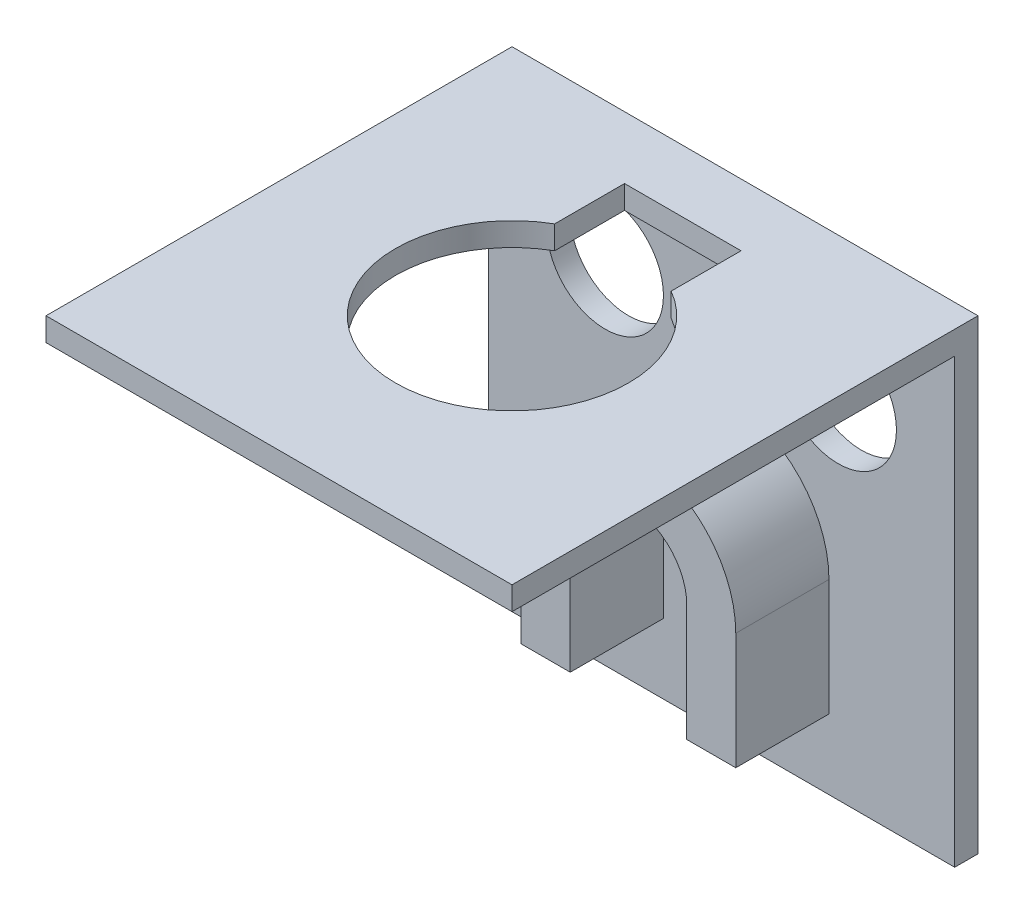
ISO-10303-21;
HEADER;
FILE_DESCRIPTION(('STEP AP214'),'2;1');
FILE_NAME('part.step','',(''),(''),'','','');
FILE_SCHEMA(('AUTOMOTIVE_DESIGN { 1 0 10303 214 1 1 1 1 }'));
ENDSEC;
DATA;
#1=APPLICATION_CONTEXT('core data for automotive mechanical design processes');
#2=APPLICATION_PROTOCOL_DEFINITION('international standard','automotive_design',2000,#1);
#3=PRODUCT_CONTEXT('',#1,'mechanical');
#4=PRODUCT('Part','Part','',(#3));
#5=PRODUCT_RELATED_PRODUCT_CATEGORY('part','',(#4));
#6=PRODUCT_DEFINITION_FORMATION('','',#4);
#7=PRODUCT_DEFINITION_CONTEXT('part definition',#1,'design');
#8=PRODUCT_DEFINITION('design','',#6,#7);
#9=PRODUCT_DEFINITION_SHAPE('','',#8);
#10=(LENGTH_UNIT() NAMED_UNIT(*) SI_UNIT(.MILLI.,.METRE.));
#11=(NAMED_UNIT(*) PLANE_ANGLE_UNIT() SI_UNIT($,.RADIAN.));
#12=(NAMED_UNIT(*) SI_UNIT($,.STERADIAN.) SOLID_ANGLE_UNIT());
#13=UNCERTAINTY_MEASURE_WITH_UNIT(LENGTH_MEASURE(1.E-05),#10,'distance_accuracy_value','');
#14=(GEOMETRIC_REPRESENTATION_CONTEXT(3) GLOBAL_UNCERTAINTY_ASSIGNED_CONTEXT((#13)) GLOBAL_UNIT_ASSIGNED_CONTEXT((#10,
#11,#12)) REPRESENTATION_CONTEXT('',''));
#15=CARTESIAN_POINT('',(0.,0.,0.));
#16=DIRECTION('',(0.,0.,1.));
#17=DIRECTION('',(1.,0.,0.));
#18=AXIS2_PLACEMENT_3D('',#15,#16,#17);
#19=CARTESIAN_POINT('',(0.,0.,1.));
#20=DIRECTION('',(0.,0.,-1.));
#21=DIRECTION('',(-1.,0.,0.));
#22=AXIS2_PLACEMENT_3D('',#19,#20,#21);
#23=PLANE('',#22);
#24=CARTESIAN_POINT('',(5.,15.,1.));
#25=DIRECTION('',(0.,0.,1.));
#26=DIRECTION('',(1.,0.,0.));
#27=AXIS2_PLACEMENT_3D('',#24,#25,#26);
#28=CIRCLE('',#27,2.5);
#29=CARTESIAN_POINT('',(7.5,15.,1.));
#30=VERTEX_POINT('',#29);
#31=EDGE_CURVE('E336',#30,#30,#28,.T.);
#32=ORIENTED_EDGE('',*,*,#31,.F.);
#33=EDGE_LOOP('',(#32));
#34=FACE_BOUND('',#33,.T.);
#35=CARTESIAN_POINT('',(15.,15.,1.));
#36=DIRECTION('',(0.,0.,1.));
#37=DIRECTION('',(1.,0.,0.));
#38=AXIS2_PLACEMENT_3D('',#35,#36,#37);
#39=CIRCLE('',#38,2.5);
#40=CARTESIAN_POINT('',(17.5,15.,1.));
#41=VERTEX_POINT('',#40);
#42=EDGE_CURVE('E330',#41,#41,#39,.T.);
#43=ORIENTED_EDGE('',*,*,#42,.F.);
#44=EDGE_LOOP('',(#43));
#45=FACE_BOUND('',#44,.T.);
#46=DIRECTION('',(0.,-1.,0.));
#47=VECTOR('',#46,1.);
#48=CARTESIAN_POINT('',(0.,0.,1.));
#49=LINE('',#48,#47);
#50=CARTESIAN_POINT('',(0.,19.,1.));
#51=VERTEX_POINT('',#50);
#52=CARTESIAN_POINT('',(0.,0.,1.));
#53=VERTEX_POINT('',#52);
#54=EDGE_CURVE('E194',#51,#53,#49,.T.);
#55=ORIENTED_EDGE('',*,*,#54,.T.);
#56=DIRECTION('',(1.,0.,0.));
#57=VECTOR('',#56,1.);
#58=CARTESIAN_POINT('',(0.,0.,1.));
#59=LINE('',#58,#57);
#60=CARTESIAN_POINT('',(20.,0.,1.));
#61=VERTEX_POINT('',#60);
#62=EDGE_CURVE('E202',#53,#61,#59,.T.);
#63=ORIENTED_EDGE('',*,*,#62,.T.);
#64=DIRECTION('',(0.,1.,0.));
#65=VECTOR('',#64,1.);
#66=CARTESIAN_POINT('',(20.,0.,1.));
#67=LINE('',#66,#65);
#68=CARTESIAN_POINT('',(20.,19.,1.));
#69=VERTEX_POINT('',#68);
#70=EDGE_CURVE('E205',#61,#69,#67,.T.);
#71=ORIENTED_EDGE('',*,*,#70,.T.);
#72=DIRECTION('',(-1.,0.,0.));
#73=VECTOR('',#72,1.);
#74=CARTESIAN_POINT('',(0.,19.,1.));
#75=LINE('',#74,#73);
#76=EDGE_CURVE('E208',#69,#51,#75,.T.);
#77=ORIENTED_EDGE('',*,*,#76,.T.);
#78=EDGE_LOOP('',(#55,#63,#71,#77));
#79=FACE_BOUND('',#78,.T.);
#80=DIRECTION('',(1.,0.,0.));
#81=VECTOR('',#80,1.);
#82=CARTESIAN_POINT('',(7.5,3.,1.));
#83=LINE('',#82,#81);
#84=CARTESIAN_POINT('',(5.39646681566496,3.,1.));
#85=VERTEX_POINT('',#84);
#86=CARTESIAN_POINT('',(7.5,3.,1.));
#87=VERTEX_POINT('',#86);
#88=EDGE_CURVE('E335',#85,#87,#83,.T.);
#89=ORIENTED_EDGE('',*,*,#88,.F.);
#90=DIRECTION('',(0.,-1.,0.));
#91=VECTOR('',#90,1.);
#92=CARTESIAN_POINT('',(5.39646681566496,3.,1.));
#93=LINE('',#92,#91);
#94=CARTESIAN_POINT('',(5.39646681566496,8.,1.));
#95=VERTEX_POINT('',#94);
#96=EDGE_CURVE('E352',#95,#85,#93,.T.);
#97=ORIENTED_EDGE('',*,*,#96,.F.);
#98=CARTESIAN_POINT('',(10.,8.,1.));
#99=DIRECTION('',(0.,0.,1.));
#100=DIRECTION('',(-1.,0.,0.));
#101=AXIS2_PLACEMENT_3D('',#98,#99,#100);
#102=CIRCLE('',#101,4.60353318433504);
#103=CARTESIAN_POINT('',(14.603533184335,8.,1.));
#104=VERTEX_POINT('',#103);
#105=EDGE_CURVE('E395',#104,#95,#102,.T.);
#106=ORIENTED_EDGE('',*,*,#105,.F.);
#107=DIRECTION('',(0.,1.,0.));
#108=VECTOR('',#107,1.);
#109=CARTESIAN_POINT('',(14.603533184335,3.,1.));
#110=LINE('',#109,#108);
#111=CARTESIAN_POINT('',(14.603533184335,3.,1.));
#112=VERTEX_POINT('',#111);
#113=EDGE_CURVE('E391',#112,#104,#110,.T.);
#114=ORIENTED_EDGE('',*,*,#113,.F.);
#115=DIRECTION('',(1.,0.,0.));
#116=VECTOR('',#115,1.);
#117=CARTESIAN_POINT('',(12.5,3.,1.));
#118=LINE('',#117,#116);
#119=CARTESIAN_POINT('',(12.5,3.,1.));
#120=VERTEX_POINT('',#119);
#121=EDGE_CURVE('E387',#120,#112,#118,.T.);
#122=ORIENTED_EDGE('',*,*,#121,.F.);
#123=DIRECTION('',(0.,-1.,0.));
#124=VECTOR('',#123,1.);
#125=CARTESIAN_POINT('',(12.5,8.,1.));
#126=LINE('',#125,#124);
#127=CARTESIAN_POINT('',(12.5,8.00000000000001,1.));
#128=VERTEX_POINT('',#127);
#129=EDGE_CURVE('E383',#128,#120,#126,.T.);
#130=ORIENTED_EDGE('',*,*,#129,.F.);
#131=CARTESIAN_POINT('',(10.,8.,1.));
#132=DIRECTION('',(0.,0.,-1.));
#133=DIRECTION('',(-1.,0.,0.));
#134=AXIS2_PLACEMENT_3D('',#131,#132,#133);
#135=CIRCLE('',#134,2.5);
#136=CARTESIAN_POINT('',(7.5,8.,1.));
#137=VERTEX_POINT('',#136);
#138=EDGE_CURVE('E379',#137,#128,#135,.T.);
#139=ORIENTED_EDGE('',*,*,#138,.F.);
#140=DIRECTION('',(0.,1.,0.));
#141=VECTOR('',#140,1.);
#142=CARTESIAN_POINT('',(7.5,3.,1.));
#143=LINE('',#142,#141);
#144=EDGE_CURVE('E63',#87,#137,#143,.T.);
#145=ORIENTED_EDGE('',*,*,#144,.F.);
#146=EDGE_LOOP('',(#89,#97,#106,#114,#122,#130,#139,#145));
#147=FACE_BOUND('',#146,.T.);
#148=ADVANCED_FACE('F39',(#34,#45,#79,#147),#23,.F.);
#149=CARTESIAN_POINT('',(0.,0.,20.));
#150=DIRECTION('',(1.,0.,0.));
#151=DIRECTION('',(0.,0.,-1.));
#152=AXIS2_PLACEMENT_3D('',#149,#150,#151);
#153=PLANE('',#152);
#154=ORIENTED_EDGE('',*,*,#54,.F.);
#155=DIRECTION('',(0.,0.,1.));
#156=VECTOR('',#155,1.);
#157=CARTESIAN_POINT('',(0.,19.,1.));
#158=LINE('',#157,#156);
#159=CARTESIAN_POINT('',(0.,19.,20.));
#160=VERTEX_POINT('',#159);
#161=EDGE_CURVE('E213',#51,#160,#158,.T.);
#162=ORIENTED_EDGE('',*,*,#161,.T.);
#163=DIRECTION('',(0.,-1.,0.));
#164=VECTOR('',#163,1.);
#165=CARTESIAN_POINT('',(0.,0.,20.));
#166=LINE('',#165,#164);
#167=CARTESIAN_POINT('',(0.,20.,20.));
#168=VERTEX_POINT('',#167);
#169=EDGE_CURVE('E220',#168,#160,#166,.T.);
#170=ORIENTED_EDGE('',*,*,#169,.F.);
#171=DIRECTION('',(0.,0.,-1.));
#172=VECTOR('',#171,1.);
#173=CARTESIAN_POINT('',(0.,20.,20.));
#174=LINE('',#173,#172);
#175=CARTESIAN_POINT('',(0.,20.,0.));
#176=VERTEX_POINT('',#175);
#177=EDGE_CURVE('E231',#168,#176,#174,.T.);
#178=ORIENTED_EDGE('',*,*,#177,.T.);
#179=DIRECTION('',(0.,-1.,0.));
#180=VECTOR('',#179,1.);
#181=CARTESIAN_POINT('',(0.,0.,0.));
#182=LINE('',#181,#180);
#183=CARTESIAN_POINT('',(0.,0.,0.));
#184=VERTEX_POINT('',#183);
#185=EDGE_CURVE('E217',#176,#184,#182,.T.);
#186=ORIENTED_EDGE('',*,*,#185,.T.);
#187=DIRECTION('',(0.,0.,-1.));
#188=VECTOR('',#187,1.);
#189=CARTESIAN_POINT('',(0.,0.,20.));
#190=LINE('',#189,#188);
#191=EDGE_CURVE('E174',#53,#184,#190,.T.);
#192=ORIENTED_EDGE('',*,*,#191,.F.);
#193=EDGE_LOOP('',(#154,#162,#170,#178,#186,#192));
#194=FACE_BOUND('',#193,.T.);
#195=ADVANCED_FACE('F41',(#194),#153,.F.);
#196=CARTESIAN_POINT('',(0.,0.,20.));
#197=DIRECTION('',(0.,1.,0.));
#198=DIRECTION('',(0.,0.,1.));
#199=AXIS2_PLACEMENT_3D('',#196,#197,#198);
#200=PLANE('',#199);
#201=DIRECTION('',(0.,0.,-1.));
#202=VECTOR('',#201,1.);
#203=CARTESIAN_POINT('',(20.,0.,20.));
#204=LINE('',#203,#202);
#205=CARTESIAN_POINT('',(20.,0.,0.));
#206=VERTEX_POINT('',#205);
#207=EDGE_CURVE('E251',#61,#206,#204,.T.);
#208=ORIENTED_EDGE('',*,*,#207,.F.);
#209=ORIENTED_EDGE('',*,*,#62,.F.);
#210=ORIENTED_EDGE('',*,*,#191,.T.);
#211=DIRECTION('',(1.,0.,0.));
#212=VECTOR('',#211,1.);
#213=CARTESIAN_POINT('',(0.,0.,0.));
#214=LINE('',#213,#212);
#215=EDGE_CURVE('E235',#184,#206,#214,.T.);
#216=ORIENTED_EDGE('',*,*,#215,.T.);
#217=EDGE_LOOP('',(#208,#209,#210,#216));
#218=FACE_BOUND('',#217,.T.);
#219=ADVANCED_FACE('F261',(#218),#200,.F.);
#220=CARTESIAN_POINT('',(20.,0.,20.));
#221=DIRECTION('',(-1.,0.,0.));
#222=DIRECTION('',(0.,0.,1.));
#223=AXIS2_PLACEMENT_3D('',#220,#221,#222);
#224=PLANE('',#223);
#225=DIRECTION('',(0.,1.,0.));
#226=VECTOR('',#225,1.);
#227=CARTESIAN_POINT('',(20.,0.,20.));
#228=LINE('',#227,#226);
#229=CARTESIAN_POINT('',(20.,19.,20.));
#230=VERTEX_POINT('',#229);
#231=CARTESIAN_POINT('',(20.,20.,20.));
#232=VERTEX_POINT('',#231);
#233=EDGE_CURVE('E224',#230,#232,#228,.T.);
#234=ORIENTED_EDGE('',*,*,#233,.F.);
#235=DIRECTION('',(0.,0.,1.));
#236=VECTOR('',#235,1.);
#237=CARTESIAN_POINT('',(20.,19.,1.));
#238=LINE('',#237,#236);
#239=EDGE_CURVE('E211',#69,#230,#238,.T.);
#240=ORIENTED_EDGE('',*,*,#239,.F.);
#241=ORIENTED_EDGE('',*,*,#70,.F.);
#242=ORIENTED_EDGE('',*,*,#207,.T.);
#243=DIRECTION('',(0.,1.,0.));
#244=VECTOR('',#243,1.);
#245=CARTESIAN_POINT('',(20.,0.,0.));
#246=LINE('',#245,#244);
#247=CARTESIAN_POINT('',(20.,20.,0.));
#248=VERTEX_POINT('',#247);
#249=EDGE_CURVE('E239',#206,#248,#246,.T.);
#250=ORIENTED_EDGE('',*,*,#249,.T.);
#251=DIRECTION('',(0.,0.,-1.));
#252=VECTOR('',#251,1.);
#253=CARTESIAN_POINT('',(20.,20.,20.));
#254=LINE('',#253,#252);
#255=EDGE_CURVE('E247',#232,#248,#254,.T.);
#256=ORIENTED_EDGE('',*,*,#255,.F.);
#257=EDGE_LOOP('',(#234,#240,#241,#242,#250,#256));
#258=FACE_BOUND('',#257,.T.);
#259=ADVANCED_FACE('F275',(#258),#224,.F.);
#260=CARTESIAN_POINT('',(0.,20.,20.));
#261=DIRECTION('',(0.,-1.,0.));
#262=DIRECTION('',(0.,0.,-1.));
#263=AXIS2_PLACEMENT_3D('',#260,#261,#262);
#264=PLANE('',#263);
#265=CARTESIAN_POINT('',(10.,20.,10.));
#266=DIRECTION('',(0.,-1.,0.));
#267=DIRECTION('',(0.,0.,-1.));
#268=AXIS2_PLACEMENT_3D('',#265,#266,#267);
#269=CIRCLE('',#268,5.);
#270=CARTESIAN_POINT('',(12.5,20.,5.6698729810778));
#271=VERTEX_POINT('',#270);
#272=CARTESIAN_POINT('',(7.5,20.,5.6698729810778));
#273=VERTEX_POINT('',#272);
#274=EDGE_CURVE('E181',#271,#273,#269,.T.);
#275=ORIENTED_EDGE('',*,*,#274,.T.);
#276=DIRECTION('',(0.,0.,1.));
#277=VECTOR('',#276,1.);
#278=CARTESIAN_POINT('',(7.5,20.,5.6698729810778));
#279=LINE('',#278,#277);
#280=CARTESIAN_POINT('',(7.5,20.,2.6698729810778));
#281=VERTEX_POINT('',#280);
#282=EDGE_CURVE('E319',#281,#273,#279,.T.);
#283=ORIENTED_EDGE('',*,*,#282,.F.);
#284=DIRECTION('',(-1.,0.,0.));
#285=VECTOR('',#284,1.);
#286=CARTESIAN_POINT('',(7.5,20.,2.6698729810778));
#287=LINE('',#286,#285);
#288=CARTESIAN_POINT('',(12.5,20.,2.6698729810778));
#289=VERTEX_POINT('',#288);
#290=EDGE_CURVE('E183',#289,#281,#287,.T.);
#291=ORIENTED_EDGE('',*,*,#290,.F.);
#292=DIRECTION('',(0.,0.,-1.));
#293=VECTOR('',#292,1.);
#294=CARTESIAN_POINT('',(12.5,20.,5.6698729810778));
#295=LINE('',#294,#293);
#296=EDGE_CURVE('E167',#271,#289,#295,.T.);
#297=ORIENTED_EDGE('',*,*,#296,.F.);
#298=EDGE_LOOP('',(#275,#283,#291,#297));
#299=FACE_BOUND('',#298,.T.);
#300=DIRECTION('',(-1.,0.,0.));
#301=VECTOR('',#300,1.);
#302=CARTESIAN_POINT('',(0.,20.,0.));
#303=LINE('',#302,#301);
#304=EDGE_CURVE('E225',#248,#176,#303,.T.);
#305=ORIENTED_EDGE('',*,*,#304,.T.);
#306=ORIENTED_EDGE('',*,*,#177,.F.);
#307=DIRECTION('',(-1.,0.,0.));
#308=VECTOR('',#307,1.);
#309=CARTESIAN_POINT('',(0.,20.,20.));
#310=LINE('',#309,#308);
#311=EDGE_CURVE('E228',#232,#168,#310,.T.);
#312=ORIENTED_EDGE('',*,*,#311,.F.);
#313=ORIENTED_EDGE('',*,*,#255,.T.);
#314=EDGE_LOOP('',(#305,#306,#312,#313));
#315=FACE_BOUND('',#314,.T.);
#316=ADVANCED_FACE('F178',(#299,#315),#264,.F.);
#317=CARTESIAN_POINT('',(0.,0.,20.));
#318=DIRECTION('',(0.,0.,-1.));
#319=DIRECTION('',(-1.,0.,0.));
#320=AXIS2_PLACEMENT_3D('',#317,#318,#319);
#321=PLANE('',#320);
#322=ORIENTED_EDGE('',*,*,#169,.T.);
#323=DIRECTION('',(-1.,0.,0.));
#324=VECTOR('',#323,1.);
#325=CARTESIAN_POINT('',(0.,19.,20.));
#326=LINE('',#325,#324);
#327=EDGE_CURVE('E189',#230,#160,#326,.T.);
#328=ORIENTED_EDGE('',*,*,#327,.F.);
#329=ORIENTED_EDGE('',*,*,#233,.T.);
#330=ORIENTED_EDGE('',*,*,#311,.T.);
#331=EDGE_LOOP('',(#322,#328,#329,#330));
#332=FACE_BOUND('',#331,.T.);
#333=ADVANCED_FACE('F284',(#332),#321,.F.);
#334=CARTESIAN_POINT('',(0.,0.,0.));
#335=DIRECTION('',(0.,0.,-1.));
#336=DIRECTION('',(-1.,0.,0.));
#337=AXIS2_PLACEMENT_3D('',#334,#335,#336);
#338=PLANE('',#337);
#339=CARTESIAN_POINT('',(5.,15.,0.));
#340=DIRECTION('',(0.,0.,1.));
#341=DIRECTION('',(1.,0.,0.));
#342=AXIS2_PLACEMENT_3D('',#339,#340,#341);
#343=CIRCLE('',#342,2.5);
#344=CARTESIAN_POINT('',(7.5,15.,0.));
#345=VERTEX_POINT('',#344);
#346=EDGE_CURVE('E331',#345,#345,#343,.T.);
#347=ORIENTED_EDGE('',*,*,#346,.T.);
#348=EDGE_LOOP('',(#347));
#349=FACE_BOUND('',#348,.T.);
#350=CARTESIAN_POINT('',(15.,15.,0.));
#351=DIRECTION('',(0.,0.,1.));
#352=DIRECTION('',(1.,0.,0.));
#353=AXIS2_PLACEMENT_3D('',#350,#351,#352);
#354=CIRCLE('',#353,2.5);
#355=CARTESIAN_POINT('',(17.5,15.,0.));
#356=VERTEX_POINT('',#355);
#357=EDGE_CURVE('E340',#356,#356,#354,.T.);
#358=ORIENTED_EDGE('',*,*,#357,.T.);
#359=EDGE_LOOP('',(#358));
#360=FACE_BOUND('',#359,.T.);
#361=ORIENTED_EDGE('',*,*,#185,.F.);
#362=ORIENTED_EDGE('',*,*,#304,.F.);
#363=ORIENTED_EDGE('',*,*,#249,.F.);
#364=ORIENTED_EDGE('',*,*,#215,.F.);
#365=EDGE_LOOP('',(#361,#362,#363,#364));
#366=FACE_BOUND('',#365,.T.);
#367=ADVANCED_FACE('F267',(#349,#360,#366),#338,.T.);
#368=CARTESIAN_POINT('',(0.,19.,1.));
#369=DIRECTION('',(0.,1.,0.));
#370=DIRECTION('',(0.,0.,1.));
#371=AXIS2_PLACEMENT_3D('',#368,#369,#370);
#372=PLANE('',#371);
#373=DIRECTION('',(-1.,0.,0.));
#374=VECTOR('',#373,1.);
#375=CARTESIAN_POINT('',(0.,19.,2.6698729810778));
#376=LINE('',#375,#374);
#377=CARTESIAN_POINT('',(12.5,19.,2.6698729810778));
#378=VERTEX_POINT('',#377);
#379=CARTESIAN_POINT('',(7.5,19.,2.6698729810778));
#380=VERTEX_POINT('',#379);
#381=EDGE_CURVE('E11',#378,#380,#376,.T.);
#382=ORIENTED_EDGE('',*,*,#381,.T.);
#383=DIRECTION('',(0.,0.,1.));
#384=VECTOR('',#383,1.);
#385=CARTESIAN_POINT('',(7.5,19.,1.));
#386=LINE('',#385,#384);
#387=CARTESIAN_POINT('',(7.5,19.,5.6698729810778));
#388=VERTEX_POINT('',#387);
#389=EDGE_CURVE('E312',#380,#388,#386,.T.);
#390=ORIENTED_EDGE('',*,*,#389,.T.);
#391=CARTESIAN_POINT('',(10.,19.,10.));
#392=DIRECTION('',(0.,-1.,0.));
#393=DIRECTION('',(0.,0.,-1.));
#394=AXIS2_PLACEMENT_3D('',#391,#392,#393);
#395=CIRCLE('',#394,5.);
#396=CARTESIAN_POINT('',(12.5,19.,5.6698729810778));
#397=VERTEX_POINT('',#396);
#398=EDGE_CURVE('E190',#397,#388,#395,.T.);
#399=ORIENTED_EDGE('',*,*,#398,.F.);
#400=DIRECTION('',(0.,0.,-1.));
#401=VECTOR('',#400,1.);
#402=CARTESIAN_POINT('',(12.5,19.,1.00000000000001));
#403=LINE('',#402,#401);
#404=EDGE_CURVE('E55',#397,#378,#403,.T.);
#405=ORIENTED_EDGE('',*,*,#404,.T.);
#406=EDGE_LOOP('',(#382,#390,#399,#405));
#407=FACE_BOUND('',#406,.T.);
#408=ORIENTED_EDGE('',*,*,#327,.T.);
#409=ORIENTED_EDGE('',*,*,#161,.F.);
#410=ORIENTED_EDGE('',*,*,#76,.F.);
#411=ORIENTED_EDGE('',*,*,#239,.T.);
#412=EDGE_LOOP('',(#408,#409,#410,#411));
#413=FACE_BOUND('',#412,.T.);
#414=ADVANCED_FACE('F281',(#407,#413),#372,.F.);
#415=CARTESIAN_POINT('',(10.,36.5,10.));
#416=DIRECTION('',(0.,-1.,0.));
#417=DIRECTION('',(0.,0.,-1.));
#418=AXIS2_PLACEMENT_3D('',#415,#416,#417);
#419=CYLINDRICAL_SURFACE('',#418,5.);
#420=ORIENTED_EDGE('',*,*,#398,.T.);
#421=DIRECTION('',(0.,-1.,0.));
#422=VECTOR('',#421,1.);
#423=CARTESIAN_POINT('',(7.5,36.5,5.6698729810778));
#424=LINE('',#423,#422);
#425=EDGE_CURVE('E48',#388,#273,#424,.F.);
#426=ORIENTED_EDGE('',*,*,#425,.T.);
#427=ORIENTED_EDGE('',*,*,#274,.F.);
#428=DIRECTION('',(0.,-1.,0.));
#429=VECTOR('',#428,1.);
#430=CARTESIAN_POINT('',(12.5,36.5,5.6698729810778));
#431=LINE('',#430,#429);
#432=EDGE_CURVE('E164',#271,#397,#431,.T.);
#433=ORIENTED_EDGE('',*,*,#432,.T.);
#434=EDGE_LOOP('',(#420,#426,#427,#433));
#435=FACE_BOUND('',#434,.T.);
#436=ADVANCED_FACE('F187',(#435),#419,.F.);
#437=CARTESIAN_POINT('',(7.5,3.,5.));
#438=DIRECTION('',(0.,1.,0.));
#439=DIRECTION('',(-1.,0.,0.));
#440=AXIS2_PLACEMENT_3D('',#437,#438,#439);
#441=PLANE('',#440);
#442=ORIENTED_EDGE('',*,*,#88,.T.);
#443=DIRECTION('',(0.,0.,-1.));
#444=VECTOR('',#443,1.);
#445=CARTESIAN_POINT('',(7.5,3.,5.));
#446=LINE('',#445,#444);
#447=CARTESIAN_POINT('',(7.5,3.,5.));
#448=VERTEX_POINT('',#447);
#449=EDGE_CURVE('E196',#448,#87,#446,.T.);
#450=ORIENTED_EDGE('',*,*,#449,.F.);
#451=DIRECTION('',(1.,0.,0.));
#452=VECTOR('',#451,1.);
#453=CARTESIAN_POINT('',(7.5,3.,5.));
#454=LINE('',#453,#452);
#455=CARTESIAN_POINT('',(5.39646681566496,3.,5.));
#456=VERTEX_POINT('',#455);
#457=EDGE_CURVE('E347',#456,#448,#454,.T.);
#458=ORIENTED_EDGE('',*,*,#457,.F.);
#459=DIRECTION('',(0.,0.,-1.));
#460=VECTOR('',#459,1.);
#461=CARTESIAN_POINT('',(5.39646681566496,3.,5.));
#462=LINE('',#461,#460);
#463=EDGE_CURVE('E373',#456,#85,#462,.T.);
#464=ORIENTED_EDGE('',*,*,#463,.T.);
#465=EDGE_LOOP('',(#442,#450,#458,#464));
#466=FACE_BOUND('',#465,.T.);
#467=ADVANCED_FACE('F310',(#466),#441,.F.);
#468=CARTESIAN_POINT('',(7.5,3.,5.));
#469=DIRECTION('',(-1.,0.,0.));
#470=DIRECTION('',(0.,-1.,0.));
#471=AXIS2_PLACEMENT_3D('',#468,#469,#470);
#472=PLANE('',#471);
#473=ORIENTED_EDGE('',*,*,#144,.T.);
#474=DIRECTION('',(0.,0.,-1.));
#475=VECTOR('',#474,1.);
#476=CARTESIAN_POINT('',(7.5,8.,5.));
#477=LINE('',#476,#475);
#478=CARTESIAN_POINT('',(7.5,8.,5.));
#479=VERTEX_POINT('',#478);
#480=EDGE_CURVE('E425',#479,#137,#477,.T.);
#481=ORIENTED_EDGE('',*,*,#480,.F.);
#482=DIRECTION('',(0.,1.,0.));
#483=VECTOR('',#482,1.);
#484=CARTESIAN_POINT('',(7.5,3.,5.));
#485=LINE('',#484,#483);
#486=EDGE_CURVE('E351',#448,#479,#485,.T.);
#487=ORIENTED_EDGE('',*,*,#486,.F.);
#488=ORIENTED_EDGE('',*,*,#449,.T.);
#489=EDGE_LOOP('',(#473,#481,#487,#488));
#490=FACE_BOUND('',#489,.T.);
#491=ADVANCED_FACE('F431',(#490),#472,.F.);
#492=CARTESIAN_POINT('',(10.,8.,5.));
#493=DIRECTION('',(0.,0.,-1.));
#494=DIRECTION('',(-1.,0.,0.));
#495=AXIS2_PLACEMENT_3D('',#492,#493,#494);
#496=CYLINDRICAL_SURFACE('',#495,2.5);
#497=ORIENTED_EDGE('',*,*,#138,.T.);
#498=DIRECTION('',(0.,0.,-1.));
#499=VECTOR('',#498,1.);
#500=CARTESIAN_POINT('',(12.5,8.00000000000001,5.));
#501=LINE('',#500,#499);
#502=CARTESIAN_POINT('',(12.5,8.00000000000001,5.));
#503=VERTEX_POINT('',#502);
#504=EDGE_CURVE('E421',#503,#128,#501,.T.);
#505=ORIENTED_EDGE('',*,*,#504,.F.);
#506=CARTESIAN_POINT('',(10.,8.,5.));
#507=DIRECTION('',(0.,0.,-1.));
#508=DIRECTION('',(-1.,0.,0.));
#509=AXIS2_PLACEMENT_3D('',#506,#507,#508);
#510=CIRCLE('',#509,2.5);
#511=EDGE_CURVE('E355',#479,#503,#510,.T.);
#512=ORIENTED_EDGE('',*,*,#511,.F.);
#513=ORIENTED_EDGE('',*,*,#480,.T.);
#514=EDGE_LOOP('',(#497,#505,#512,#513));
#515=FACE_BOUND('',#514,.T.);
#516=ADVANCED_FACE('F458',(#515),#496,.F.);
#517=CARTESIAN_POINT('',(12.5,8.,5.));
#518=DIRECTION('',(1.,0.,0.));
#519=DIRECTION('',(0.,1.,0.));
#520=AXIS2_PLACEMENT_3D('',#517,#518,#519);
#521=PLANE('',#520);
#522=ORIENTED_EDGE('',*,*,#129,.T.);
#523=DIRECTION('',(0.,0.,-1.));
#524=VECTOR('',#523,1.);
#525=CARTESIAN_POINT('',(12.5,3.,5.));
#526=LINE('',#525,#524);
#527=CARTESIAN_POINT('',(12.5,3.,5.));
#528=VERTEX_POINT('',#527);
#529=EDGE_CURVE('E417',#528,#120,#526,.T.);
#530=ORIENTED_EDGE('',*,*,#529,.F.);
#531=DIRECTION('',(0.,-1.,0.));
#532=VECTOR('',#531,1.);
#533=CARTESIAN_POINT('',(12.5,8.,5.));
#534=LINE('',#533,#532);
#535=EDGE_CURVE('E358',#503,#528,#534,.T.);
#536=ORIENTED_EDGE('',*,*,#535,.F.);
#537=ORIENTED_EDGE('',*,*,#504,.T.);
#538=EDGE_LOOP('',(#522,#530,#536,#537));
#539=FACE_BOUND('',#538,.T.);
#540=ADVANCED_FACE('F453',(#539),#521,.F.);
#541=CARTESIAN_POINT('',(12.5,3.,5.));
#542=DIRECTION('',(0.,1.,0.));
#543=DIRECTION('',(0.,0.,1.));
#544=AXIS2_PLACEMENT_3D('',#541,#542,#543);
#545=PLANE('',#544);
#546=ORIENTED_EDGE('',*,*,#121,.T.);
#547=DIRECTION('',(0.,0.,-1.));
#548=VECTOR('',#547,1.);
#549=CARTESIAN_POINT('',(14.603533184335,3.,5.));
#550=LINE('',#549,#548);
#551=CARTESIAN_POINT('',(14.603533184335,3.,5.));
#552=VERTEX_POINT('',#551);
#553=EDGE_CURVE('E413',#552,#112,#550,.T.);
#554=ORIENTED_EDGE('',*,*,#553,.F.);
#555=DIRECTION('',(1.,0.,0.));
#556=VECTOR('',#555,1.);
#557=CARTESIAN_POINT('',(12.5,3.,5.));
#558=LINE('',#557,#556);
#559=EDGE_CURVE('E361',#528,#552,#558,.T.);
#560=ORIENTED_EDGE('',*,*,#559,.F.);
#561=ORIENTED_EDGE('',*,*,#529,.T.);
#562=EDGE_LOOP('',(#546,#554,#560,#561));
#563=FACE_BOUND('',#562,.T.);
#564=ADVANCED_FACE('F450',(#563),#545,.F.);
#565=CARTESIAN_POINT('',(14.603533184335,3.,5.));
#566=DIRECTION('',(-1.,0.,0.));
#567=DIRECTION('',(0.,-1.,0.));
#568=AXIS2_PLACEMENT_3D('',#565,#566,#567);
#569=PLANE('',#568);
#570=ORIENTED_EDGE('',*,*,#113,.T.);
#571=DIRECTION('',(0.,0.,-1.));
#572=VECTOR('',#571,1.);
#573=CARTESIAN_POINT('',(14.603533184335,8.,5.));
#574=LINE('',#573,#572);
#575=CARTESIAN_POINT('',(14.603533184335,8.,5.));
#576=VERTEX_POINT('',#575);
#577=EDGE_CURVE('E409',#576,#104,#574,.T.);
#578=ORIENTED_EDGE('',*,*,#577,.F.);
#579=DIRECTION('',(0.,1.,0.));
#580=VECTOR('',#579,1.);
#581=CARTESIAN_POINT('',(14.603533184335,3.,5.));
#582=LINE('',#581,#580);
#583=EDGE_CURVE('E364',#552,#576,#582,.T.);
#584=ORIENTED_EDGE('',*,*,#583,.F.);
#585=ORIENTED_EDGE('',*,*,#553,.T.);
#586=EDGE_LOOP('',(#570,#578,#584,#585));
#587=FACE_BOUND('',#586,.T.);
#588=ADVANCED_FACE('F445',(#587),#569,.F.);
#589=CARTESIAN_POINT('',(10.,8.,5.));
#590=DIRECTION('',(0.,0.,-1.));
#591=DIRECTION('',(-1.,0.,0.));
#592=AXIS2_PLACEMENT_3D('',#589,#590,#591);
#593=CYLINDRICAL_SURFACE('',#592,4.60353318433504);
#594=ORIENTED_EDGE('',*,*,#105,.T.);
#595=DIRECTION('',(0.,0.,-1.));
#596=VECTOR('',#595,1.);
#597=CARTESIAN_POINT('',(5.39646681566496,8.,5.));
#598=LINE('',#597,#596);
#599=CARTESIAN_POINT('',(5.39646681566496,8.,5.));
#600=VERTEX_POINT('',#599);
#601=EDGE_CURVE('E405',#600,#95,#598,.T.);
#602=ORIENTED_EDGE('',*,*,#601,.F.);
#603=CARTESIAN_POINT('',(10.,8.,5.));
#604=DIRECTION('',(0.,0.,1.));
#605=DIRECTION('',(-1.,0.,0.));
#606=AXIS2_PLACEMENT_3D('',#603,#604,#605);
#607=CIRCLE('',#606,4.60353318433504);
#608=EDGE_CURVE('E367',#576,#600,#607,.T.);
#609=ORIENTED_EDGE('',*,*,#608,.F.);
#610=ORIENTED_EDGE('',*,*,#577,.T.);
#611=EDGE_LOOP('',(#594,#602,#609,#610));
#612=FACE_BOUND('',#611,.T.);
#613=ADVANCED_FACE('F442',(#612),#593,.T.);
#614=CARTESIAN_POINT('',(5.39646681566496,3.,5.));
#615=DIRECTION('',(1.,0.,0.));
#616=DIRECTION('',(0.,0.,-1.));
#617=AXIS2_PLACEMENT_3D('',#614,#615,#616);
#618=PLANE('',#617);
#619=ORIENTED_EDGE('',*,*,#96,.T.);
#620=ORIENTED_EDGE('',*,*,#463,.F.);
#621=DIRECTION('',(0.,-1.,0.));
#622=VECTOR('',#621,1.);
#623=CARTESIAN_POINT('',(5.39646681566496,3.,5.));
#624=LINE('',#623,#622);
#625=EDGE_CURVE('E370',#600,#456,#624,.T.);
#626=ORIENTED_EDGE('',*,*,#625,.F.);
#627=ORIENTED_EDGE('',*,*,#601,.T.);
#628=EDGE_LOOP('',(#619,#620,#626,#627));
#629=FACE_BOUND('',#628,.T.);
#630=ADVANCED_FACE('F437',(#629),#618,.F.);
#631=CARTESIAN_POINT('',(10.,8.,5.));
#632=DIRECTION('',(0.,0.,-1.));
#633=DIRECTION('',(-1.,0.,0.));
#634=AXIS2_PLACEMENT_3D('',#631,#632,#633);
#635=PLANE('',#634);
#636=ORIENTED_EDGE('',*,*,#457,.T.);
#637=ORIENTED_EDGE('',*,*,#486,.T.);
#638=ORIENTED_EDGE('',*,*,#511,.T.);
#639=ORIENTED_EDGE('',*,*,#535,.T.);
#640=ORIENTED_EDGE('',*,*,#559,.T.);
#641=ORIENTED_EDGE('',*,*,#583,.T.);
#642=ORIENTED_EDGE('',*,*,#608,.T.);
#643=ORIENTED_EDGE('',*,*,#625,.T.);
#644=EDGE_LOOP('',(#636,#637,#638,#639,#640,#641,#642,#643));
#645=FACE_BOUND('',#644,.T.);
#646=ADVANCED_FACE('F460',(#645),#635,.F.);
#647=CARTESIAN_POINT('',(15.,15.,0.));
#648=DIRECTION('',(0.,0.,1.));
#649=DIRECTION('',(1.,0.,0.));
#650=AXIS2_PLACEMENT_3D('',#647,#648,#649);
#651=CYLINDRICAL_SURFACE('',#650,2.5);
#652=ORIENTED_EDGE('',*,*,#357,.F.);
#653=EDGE_LOOP('',(#652));
#654=FACE_BOUND('',#653,.T.);
#655=ORIENTED_EDGE('',*,*,#42,.T.);
#656=EDGE_LOOP('',(#655));
#657=FACE_BOUND('',#656,.T.);
#658=ADVANCED_FACE('F462',(#654,#657),#651,.F.);
#659=CARTESIAN_POINT('',(5.,15.,0.));
#660=DIRECTION('',(0.,0.,1.));
#661=DIRECTION('',(1.,0.,0.));
#662=AXIS2_PLACEMENT_3D('',#659,#660,#661);
#663=CYLINDRICAL_SURFACE('',#662,2.5);
#664=ORIENTED_EDGE('',*,*,#346,.F.);
#665=EDGE_LOOP('',(#664));
#666=FACE_BOUND('',#665,.T.);
#667=ORIENTED_EDGE('',*,*,#31,.T.);
#668=EDGE_LOOP('',(#667));
#669=FACE_BOUND('',#668,.T.);
#670=ADVANCED_FACE('F468',(#666,#669),#663,.F.);
#671=CARTESIAN_POINT('',(7.5,18.,2.6698729810778));
#672=DIRECTION('',(0.,0.,-1.));
#673=DIRECTION('',(-1.,0.,0.));
#674=AXIS2_PLACEMENT_3D('',#671,#672,#673);
#675=PLANE('',#674);
#676=DIRECTION('',(0.,1.,0.));
#677=VECTOR('',#676,1.);
#678=CARTESIAN_POINT('',(12.5,18.,2.6698729810778));
#679=LINE('',#678,#677);
#680=EDGE_CURVE('E316',#378,#289,#679,.T.);
#681=ORIENTED_EDGE('',*,*,#680,.T.);
#682=ORIENTED_EDGE('',*,*,#290,.T.);
#683=DIRECTION('',(0.,1.,0.));
#684=VECTOR('',#683,1.);
#685=CARTESIAN_POINT('',(7.5,18.,2.6698729810778));
#686=LINE('',#685,#684);
#687=EDGE_CURVE('E317',#380,#281,#686,.T.);
#688=ORIENTED_EDGE('',*,*,#687,.F.);
#689=ORIENTED_EDGE('',*,*,#381,.F.);
#690=EDGE_LOOP('',(#681,#682,#688,#689));
#691=FACE_BOUND('',#690,.T.);
#692=ADVANCED_FACE('F315',(#691),#675,.F.);
#693=CARTESIAN_POINT('',(7.5,18.,5.6698729810778));
#694=DIRECTION('',(-1.,0.,0.));
#695=DIRECTION('',(0.,0.,1.));
#696=AXIS2_PLACEMENT_3D('',#693,#694,#695);
#697=PLANE('',#696);
#698=ORIENTED_EDGE('',*,*,#687,.T.);
#699=ORIENTED_EDGE('',*,*,#282,.T.);
#700=ORIENTED_EDGE('',*,*,#425,.F.);
#701=ORIENTED_EDGE('',*,*,#389,.F.);
#702=EDGE_LOOP('',(#698,#699,#700,#701));
#703=FACE_BOUND('',#702,.T.);
#704=ADVANCED_FACE('F572',(#703),#697,.F.);
#705=CARTESIAN_POINT('',(12.5,18.,5.6698729810778));
#706=DIRECTION('',(1.,0.,0.));
#707=DIRECTION('',(0.,0.,-1.));
#708=AXIS2_PLACEMENT_3D('',#705,#706,#707);
#709=PLANE('',#708);
#710=ORIENTED_EDGE('',*,*,#432,.F.);
#711=ORIENTED_EDGE('',*,*,#296,.T.);
#712=ORIENTED_EDGE('',*,*,#680,.F.);
#713=ORIENTED_EDGE('',*,*,#404,.F.);
#714=EDGE_LOOP('',(#710,#711,#712,#713));
#715=FACE_BOUND('',#714,.T.);
#716=ADVANCED_FACE('F166',(#715),#709,.F.);
#717=CLOSED_SHELL('',(#148,#195,#219,#259,#316,#333,#367,#414,#436,#467,#491,#516,#540,#564,
#588,#613,#630,#646,#658,#670,#692,#704,#716));
#718=MANIFOLD_SOLID_BREP('B2',#717);
#719=ADVANCED_BREP_SHAPE_REPRESENTATION('',(#18,#718),#14);
#720=SHAPE_DEFINITION_REPRESENTATION(#9,#719);
ENDSEC;
END-ISO-10303-21;
